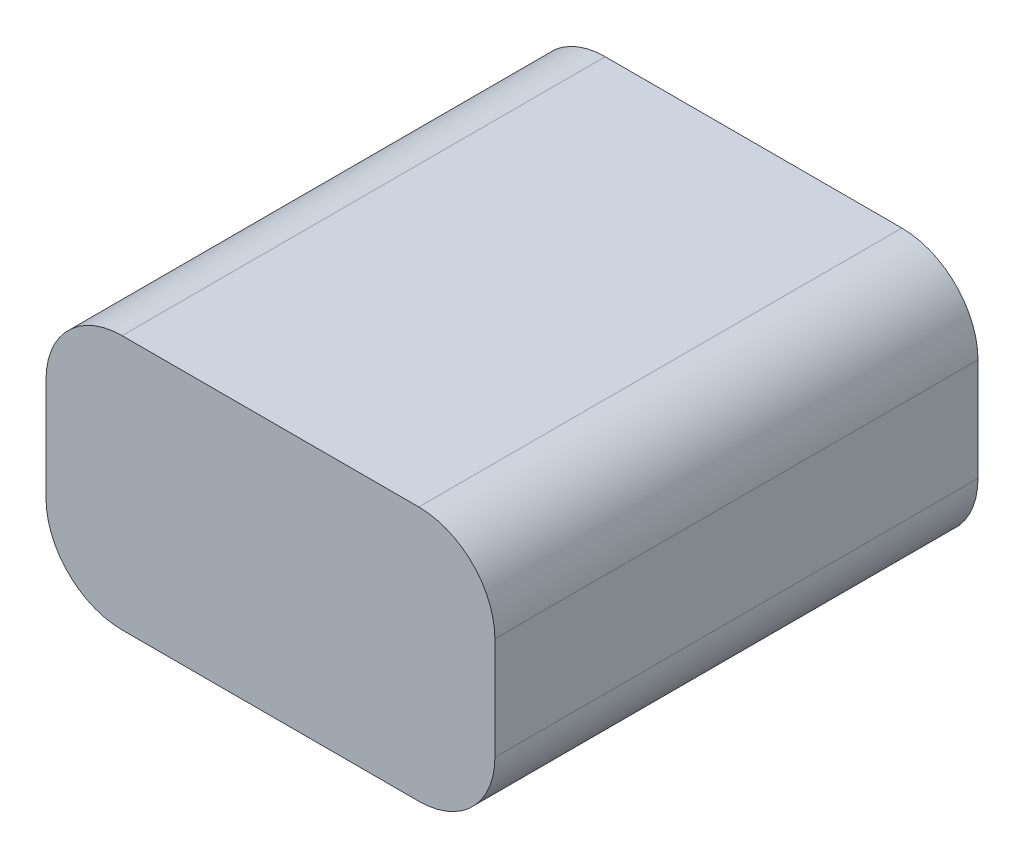
ISO-10303-21;
HEADER;
FILE_DESCRIPTION(('STEP AP214'),'2;1');
FILE_NAME('part.step','',(''),(''),'','','');
FILE_SCHEMA(('AUTOMOTIVE_DESIGN { 1 0 10303 214 1 1 1 1 }'));
ENDSEC;
DATA;
#1=APPLICATION_CONTEXT('core data for automotive mechanical design processes');
#2=APPLICATION_PROTOCOL_DEFINITION('international standard','automotive_design',2000,#1);
#3=PRODUCT_CONTEXT('',#1,'mechanical');
#4=PRODUCT('Part','Part','',(#3));
#5=PRODUCT_RELATED_PRODUCT_CATEGORY('part','',(#4));
#6=PRODUCT_DEFINITION_FORMATION('','',#4);
#7=PRODUCT_DEFINITION_CONTEXT('part definition',#1,'design');
#8=PRODUCT_DEFINITION('design','',#6,#7);
#9=PRODUCT_DEFINITION_SHAPE('','',#8);
#10=(LENGTH_UNIT() NAMED_UNIT(*) SI_UNIT(.MILLI.,.METRE.));
#11=(NAMED_UNIT(*) PLANE_ANGLE_UNIT() SI_UNIT($,.RADIAN.));
#12=(NAMED_UNIT(*) SI_UNIT($,.STERADIAN.) SOLID_ANGLE_UNIT());
#13=UNCERTAINTY_MEASURE_WITH_UNIT(LENGTH_MEASURE(1.E-05),#10,'distance_accuracy_value','');
#14=(GEOMETRIC_REPRESENTATION_CONTEXT(3) GLOBAL_UNCERTAINTY_ASSIGNED_CONTEXT((#13)) GLOBAL_UNIT_ASSIGNED_CONTEXT((#10,
#11,#12)) REPRESENTATION_CONTEXT('',''));
#15=CARTESIAN_POINT('',(0.,0.,0.));
#16=DIRECTION('',(0.,0.,1.));
#17=DIRECTION('',(1.,0.,0.));
#18=AXIS2_PLACEMENT_3D('',#15,#16,#17);
#19=CARTESIAN_POINT('',(-29.5000000000001,33.5,-31.7499999999994));
#20=DIRECTION('',(1.,0.,0.));
#21=DIRECTION('',(0.,0.,-1.));
#22=AXIS2_PLACEMENT_3D('',#19,#20,#21);
#23=PLANE('',#22);
#24=DIRECTION('',(0.,-1.,0.));
#25=VECTOR('',#24,1.);
#26=CARTESIAN_POINT('',(-29.5000000000002,33.5,31.7500000000007));
#27=LINE('',#26,#25);
#28=CARTESIAN_POINT('',(-29.5000000000002,23.5,31.7500000000007));
#29=VERTEX_POINT('',#28);
#30=CARTESIAN_POINT('',(-29.5000000000002,10.,31.7500000000007));
#31=VERTEX_POINT('',#30);
#32=EDGE_CURVE('E115',#29,#31,#27,.T.);
#33=ORIENTED_EDGE('',*,*,#32,.F.);
#34=DIRECTION('',(0.,0.,1.));
#35=VECTOR('',#34,1.);
#36=CARTESIAN_POINT('',(-29.5000000000001,23.5,-31.7499999999994));
#37=LINE('',#36,#35);
#38=CARTESIAN_POINT('',(-29.5000000000001,23.5,-31.7499999999994));
#39=VERTEX_POINT('',#38);
#40=EDGE_CURVE('E11',#29,#39,#37,.F.);
#41=ORIENTED_EDGE('',*,*,#40,.T.);
#42=DIRECTION('',(0.,-1.,0.));
#43=VECTOR('',#42,1.);
#44=CARTESIAN_POINT('',(-29.5000000000001,33.5,-31.7499999999994));
#45=LINE('',#44,#43);
#46=CARTESIAN_POINT('',(-29.5000000000001,10.,-31.7499999999994));
#47=VERTEX_POINT('',#46);
#48=EDGE_CURVE('E123',#39,#47,#45,.T.);
#49=ORIENTED_EDGE('',*,*,#48,.T.);
#50=DIRECTION('',(0.,0.,1.));
#51=VECTOR('',#50,1.);
#52=CARTESIAN_POINT('',(-29.5000000000002,10.,31.7500000000007));
#53=LINE('',#52,#51);
#54=EDGE_CURVE('E41',#47,#31,#53,.T.);
#55=ORIENTED_EDGE('',*,*,#54,.T.);
#56=EDGE_LOOP('',(#33,#41,#49,#55));
#57=FACE_BOUND('',#56,.T.);
#58=ADVANCED_FACE('F33',(#57),#23,.F.);
#59=CARTESIAN_POINT('',(29.4999999999999,33.5,31.7500000000008));
#60=DIRECTION('',(0.,0.,-1.));
#61=DIRECTION('',(-1.,0.,0.));
#62=AXIS2_PLACEMENT_3D('',#59,#60,#61);
#63=PLANE('',#62);
#64=DIRECTION('',(0.,-1.,0.));
#65=VECTOR('',#64,1.);
#66=CARTESIAN_POINT('',(29.4999999999999,33.5,31.7500000000008));
#67=LINE('',#66,#65);
#68=CARTESIAN_POINT('',(29.4999999999999,23.5,31.7500000000008));
#69=VERTEX_POINT('',#68);
#70=CARTESIAN_POINT('',(29.4999999999999,10.,31.7500000000008));
#71=VERTEX_POINT('',#70);
#72=EDGE_CURVE('E136',#69,#71,#67,.T.);
#73=ORIENTED_EDGE('',*,*,#72,.F.);
#74=CARTESIAN_POINT('',(19.4999999999999,23.5,31.7500000000008));
#75=DIRECTION('',(0.,0.,-1.));
#76=DIRECTION('',(-1.,0.,0.));
#77=AXIS2_PLACEMENT_3D('',#74,#75,#76);
#78=CIRCLE('',#77,10.);
#79=CARTESIAN_POINT('',(19.4999999999999,33.5,31.7500000000008));
#80=VERTEX_POINT('',#79);
#81=EDGE_CURVE('E120',#69,#80,#78,.F.);
#82=ORIENTED_EDGE('',*,*,#81,.T.);
#83=DIRECTION('',(1.,0.,0.));
#84=VECTOR('',#83,1.);
#85=CARTESIAN_POINT('',(29.4999999999999,33.5,31.7500000000008));
#86=LINE('',#85,#84);
#87=CARTESIAN_POINT('',(-19.5000000000002,33.5,31.7500000000007));
#88=VERTEX_POINT('',#87);
#89=EDGE_CURVE('E110',#88,#80,#86,.T.);
#90=ORIENTED_EDGE('',*,*,#89,.F.);
#91=CARTESIAN_POINT('',(-19.5000000000002,23.5,31.7500000000007));
#92=DIRECTION('',(0.,0.,-1.));
#93=DIRECTION('',(-1.,0.,0.));
#94=AXIS2_PLACEMENT_3D('',#91,#92,#93);
#95=CIRCLE('',#94,10.);
#96=EDGE_CURVE('E56',#88,#29,#95,.F.);
#97=ORIENTED_EDGE('',*,*,#96,.T.);
#98=ORIENTED_EDGE('',*,*,#32,.T.);
#99=CARTESIAN_POINT('',(-19.5000000000002,10.,31.7500000000007));
#100=DIRECTION('',(0.,0.,-1.));
#101=DIRECTION('',(-1.,0.,0.));
#102=AXIS2_PLACEMENT_3D('',#99,#100,#101);
#103=CIRCLE('',#102,10.);
#104=CARTESIAN_POINT('',(-19.5000000000002,0.,31.7500000000007));
#105=VERTEX_POINT('',#104);
#106=EDGE_CURVE('E48',#31,#105,#103,.F.);
#107=ORIENTED_EDGE('',*,*,#106,.T.);
#108=DIRECTION('',(1.,0.,0.));
#109=VECTOR('',#108,1.);
#110=CARTESIAN_POINT('',(29.4999999999999,0.,31.7500000000008));
#111=LINE('',#110,#109);
#112=CARTESIAN_POINT('',(19.4999999999999,0.,31.7500000000008));
#113=VERTEX_POINT('',#112);
#114=EDGE_CURVE('E126',#105,#113,#111,.T.);
#115=ORIENTED_EDGE('',*,*,#114,.T.);
#116=CARTESIAN_POINT('',(19.4999999999999,10.,31.7500000000008));
#117=DIRECTION('',(0.,0.,-1.));
#118=DIRECTION('',(-1.,0.,0.));
#119=AXIS2_PLACEMENT_3D('',#116,#117,#118);
#120=CIRCLE('',#119,10.);
#121=EDGE_CURVE('E103',#113,#71,#120,.F.);
#122=ORIENTED_EDGE('',*,*,#121,.T.);
#123=EDGE_LOOP('',(#73,#82,#90,#97,#98,#107,#115,#122));
#124=FACE_BOUND('',#123,.T.);
#125=ADVANCED_FACE('F118',(#124),#63,.F.);
#126=CARTESIAN_POINT('',(29.4999999999999,33.5,-31.7499999999993));
#127=DIRECTION('',(-1.,0.,0.));
#128=DIRECTION('',(0.,0.,1.));
#129=AXIS2_PLACEMENT_3D('',#126,#127,#128);
#130=PLANE('',#129);
#131=DIRECTION('',(0.,-1.,0.));
#132=VECTOR('',#131,1.);
#133=CARTESIAN_POINT('',(29.4999999999999,33.5,-31.7499999999993));
#134=LINE('',#133,#132);
#135=CARTESIAN_POINT('',(29.4999999999999,23.5,-31.7499999999993));
#136=VERTEX_POINT('',#135);
#137=CARTESIAN_POINT('',(29.4999999999999,10.,-31.7499999999993));
#138=VERTEX_POINT('',#137);
#139=EDGE_CURVE('E133',#136,#138,#134,.T.);
#140=ORIENTED_EDGE('',*,*,#139,.F.);
#141=DIRECTION('',(0.,0.,-1.));
#142=VECTOR('',#141,1.);
#143=CARTESIAN_POINT('',(29.4999999999999,23.5,-31.7499999999993));
#144=LINE('',#143,#142);
#145=EDGE_CURVE('E152',#136,#69,#144,.F.);
#146=ORIENTED_EDGE('',*,*,#145,.T.);
#147=ORIENTED_EDGE('',*,*,#72,.T.);
#148=DIRECTION('',(0.,0.,-1.));
#149=VECTOR('',#148,1.);
#150=CARTESIAN_POINT('',(29.4999999999999,10.,-31.7499999999993));
#151=LINE('',#150,#149);
#152=EDGE_CURVE('E149',#71,#138,#151,.T.);
#153=ORIENTED_EDGE('',*,*,#152,.T.);
#154=EDGE_LOOP('',(#140,#146,#147,#153));
#155=FACE_BOUND('',#154,.T.);
#156=ADVANCED_FACE('F176',(#155),#130,.F.);
#157=CARTESIAN_POINT('',(29.4999999999999,33.5,-31.7499999999993));
#158=DIRECTION('',(0.,0.,1.));
#159=DIRECTION('',(1.,0.,0.));
#160=AXIS2_PLACEMENT_3D('',#157,#158,#159);
#161=PLANE('',#160);
#162=DIRECTION('',(-1.,0.,0.));
#163=VECTOR('',#162,1.);
#164=CARTESIAN_POINT('',(29.4999999999999,33.5,-31.7499999999993));
#165=LINE('',#164,#163);
#166=CARTESIAN_POINT('',(19.4999999999999,33.5,-31.7499999999993));
#167=VERTEX_POINT('',#166);
#168=CARTESIAN_POINT('',(-19.5000000000001,33.5,-31.7499999999994));
#169=VERTEX_POINT('',#168);
#170=EDGE_CURVE('E113',#167,#169,#165,.T.);
#171=ORIENTED_EDGE('',*,*,#170,.F.);
#172=CARTESIAN_POINT('',(19.4999999999999,23.5,-31.7499999999993));
#173=DIRECTION('',(0.,0.,1.));
#174=DIRECTION('',(1.,0.,0.));
#175=AXIS2_PLACEMENT_3D('',#172,#173,#174);
#176=CIRCLE('',#175,10.);
#177=EDGE_CURVE('E147',#167,#136,#176,.F.);
#178=ORIENTED_EDGE('',*,*,#177,.T.);
#179=ORIENTED_EDGE('',*,*,#139,.T.);
#180=CARTESIAN_POINT('',(19.4999999999999,10.,-31.7499999999993));
#181=DIRECTION('',(0.,0.,1.));
#182=DIRECTION('',(1.,0.,0.));
#183=AXIS2_PLACEMENT_3D('',#180,#181,#182);
#184=CIRCLE('',#183,10.);
#185=CARTESIAN_POINT('',(19.4999999999999,0.,-31.7499999999993));
#186=VERTEX_POINT('',#185);
#187=EDGE_CURVE('E145',#138,#186,#184,.F.);
#188=ORIENTED_EDGE('',*,*,#187,.T.);
#189=DIRECTION('',(-1.,0.,0.));
#190=VECTOR('',#189,1.);
#191=CARTESIAN_POINT('',(29.4999999999999,0.,-31.7499999999993));
#192=LINE('',#191,#190);
#193=CARTESIAN_POINT('',(-19.5000000000001,0.,-31.7499999999994));
#194=VERTEX_POINT('',#193);
#195=EDGE_CURVE('E121',#186,#194,#192,.T.);
#196=ORIENTED_EDGE('',*,*,#195,.T.);
#197=CARTESIAN_POINT('',(-19.5000000000001,10.,-31.7499999999994));
#198=DIRECTION('',(0.,0.,1.));
#199=DIRECTION('',(1.,0.,0.));
#200=AXIS2_PLACEMENT_3D('',#197,#198,#199);
#201=CIRCLE('',#200,10.);
#202=EDGE_CURVE('E141',#194,#47,#201,.F.);
#203=ORIENTED_EDGE('',*,*,#202,.T.);
#204=ORIENTED_EDGE('',*,*,#48,.F.);
#205=CARTESIAN_POINT('',(-19.5000000000001,23.5,-31.7499999999994));
#206=DIRECTION('',(0.,0.,1.));
#207=DIRECTION('',(1.,0.,0.));
#208=AXIS2_PLACEMENT_3D('',#205,#206,#207);
#209=CIRCLE('',#208,10.);
#210=EDGE_CURVE('E143',#39,#169,#209,.F.);
#211=ORIENTED_EDGE('',*,*,#210,.T.);
#212=EDGE_LOOP('',(#171,#178,#179,#188,#196,#203,#204,#211));
#213=FACE_BOUND('',#212,.T.);
#214=ADVANCED_FACE('F170',(#213),#161,.F.);
#215=CARTESIAN_POINT('',(0.,33.5,0.));
#216=DIRECTION('',(0.,-1.,0.));
#217=DIRECTION('',(0.,0.,-1.));
#218=AXIS2_PLACEMENT_3D('',#215,#216,#217);
#219=PLANE('',#218);
#220=ORIENTED_EDGE('',*,*,#89,.T.);
#221=DIRECTION('',(0.,0.,-1.));
#222=VECTOR('',#221,1.);
#223=CARTESIAN_POINT('',(19.4999999999999,33.5,0.));
#224=LINE('',#223,#222);
#225=EDGE_CURVE('E114',#80,#167,#224,.T.);
#226=ORIENTED_EDGE('',*,*,#225,.T.);
#227=ORIENTED_EDGE('',*,*,#170,.T.);
#228=DIRECTION('',(0.,0.,1.));
#229=VECTOR('',#228,1.);
#230=CARTESIAN_POINT('',(-19.5000000000001,33.5,0.));
#231=LINE('',#230,#229);
#232=EDGE_CURVE('E102',#169,#88,#231,.T.);
#233=ORIENTED_EDGE('',*,*,#232,.T.);
#234=EDGE_LOOP('',(#220,#226,#227,#233));
#235=FACE_BOUND('',#234,.T.);
#236=ADVANCED_FACE('F108',(#235),#219,.F.);
#237=CARTESIAN_POINT('',(0.,0.,0.));
#238=DIRECTION('',(0.,-1.,0.));
#239=DIRECTION('',(0.,0.,-1.));
#240=AXIS2_PLACEMENT_3D('',#237,#238,#239);
#241=PLANE('',#240);
#242=ORIENTED_EDGE('',*,*,#195,.F.);
#243=DIRECTION('',(0.,0.,-1.));
#244=VECTOR('',#243,1.);
#245=CARTESIAN_POINT('',(19.4999999999999,0.,31.7500000000008));
#246=LINE('',#245,#244);
#247=EDGE_CURVE('E159',#186,#113,#246,.F.);
#248=ORIENTED_EDGE('',*,*,#247,.T.);
#249=ORIENTED_EDGE('',*,*,#114,.F.);
#250=DIRECTION('',(0.,0.,1.));
#251=VECTOR('',#250,1.);
#252=CARTESIAN_POINT('',(-19.5000000000001,0.,-31.7499999999994));
#253=LINE('',#252,#251);
#254=EDGE_CURVE('E157',#105,#194,#253,.F.);
#255=ORIENTED_EDGE('',*,*,#254,.T.);
#256=EDGE_LOOP('',(#242,#248,#249,#255));
#257=FACE_BOUND('',#256,.T.);
#258=ADVANCED_FACE('F167',(#257),#241,.T.);
#259=CARTESIAN_POINT('',(19.4999999999999,23.5,0.));
#260=DIRECTION('',(0.,0.,-1.));
#261=DIRECTION('',(-1.,0.,0.));
#262=AXIS2_PLACEMENT_3D('',#259,#260,#261);
#263=CYLINDRICAL_SURFACE('',#262,10.);
#264=ORIENTED_EDGE('',*,*,#81,.F.);
#265=ORIENTED_EDGE('',*,*,#145,.F.);
#266=ORIENTED_EDGE('',*,*,#177,.F.);
#267=ORIENTED_EDGE('',*,*,#225,.F.);
#268=EDGE_LOOP('',(#264,#265,#266,#267));
#269=FACE_BOUND('',#268,.T.);
#270=ADVANCED_FACE('F179',(#269),#263,.T.);
#271=CARTESIAN_POINT('',(19.4999999999999,10.,-31.7499999999993));
#272=DIRECTION('',(0.,0.,1.));
#273=DIRECTION('',(1.,0.,0.));
#274=AXIS2_PLACEMENT_3D('',#271,#272,#273);
#275=CYLINDRICAL_SURFACE('',#274,10.);
#276=ORIENTED_EDGE('',*,*,#121,.F.);
#277=ORIENTED_EDGE('',*,*,#247,.F.);
#278=ORIENTED_EDGE('',*,*,#187,.F.);
#279=ORIENTED_EDGE('',*,*,#152,.F.);
#280=EDGE_LOOP('',(#276,#277,#278,#279));
#281=FACE_BOUND('',#280,.T.);
#282=ADVANCED_FACE('F172',(#281),#275,.T.);
#283=CARTESIAN_POINT('',(-19.5000000000001,23.5,0.));
#284=DIRECTION('',(0.,0.,1.));
#285=DIRECTION('',(1.,0.,0.));
#286=AXIS2_PLACEMENT_3D('',#283,#284,#285);
#287=CYLINDRICAL_SURFACE('',#286,10.);
#288=ORIENTED_EDGE('',*,*,#210,.F.);
#289=ORIENTED_EDGE('',*,*,#40,.F.);
#290=ORIENTED_EDGE('',*,*,#96,.F.);
#291=ORIENTED_EDGE('',*,*,#232,.F.);
#292=EDGE_LOOP('',(#288,#289,#290,#291));
#293=FACE_BOUND('',#292,.T.);
#294=ADVANCED_FACE('F101',(#293),#287,.T.);
#295=CARTESIAN_POINT('',(-19.5000000000001,10.,-31.7499999999994));
#296=DIRECTION('',(0.,0.,-1.));
#297=DIRECTION('',(-1.,0.,0.));
#298=AXIS2_PLACEMENT_3D('',#295,#296,#297);
#299=CYLINDRICAL_SURFACE('',#298,10.);
#300=ORIENTED_EDGE('',*,*,#202,.F.);
#301=ORIENTED_EDGE('',*,*,#254,.F.);
#302=ORIENTED_EDGE('',*,*,#106,.F.);
#303=ORIENTED_EDGE('',*,*,#54,.F.);
#304=EDGE_LOOP('',(#300,#301,#302,#303));
#305=FACE_BOUND('',#304,.T.);
#306=ADVANCED_FACE('F35',(#305),#299,.T.);
#307=CLOSED_SHELL('',(#58,#125,#156,#214,#236,#258,#270,#282,#294,#306));
#308=MANIFOLD_SOLID_BREP('B2',#307);
#309=ADVANCED_BREP_SHAPE_REPRESENTATION('',(#18,#308),#14);
#310=SHAPE_DEFINITION_REPRESENTATION(#9,#309);
ENDSEC;
END-ISO-10303-21;
